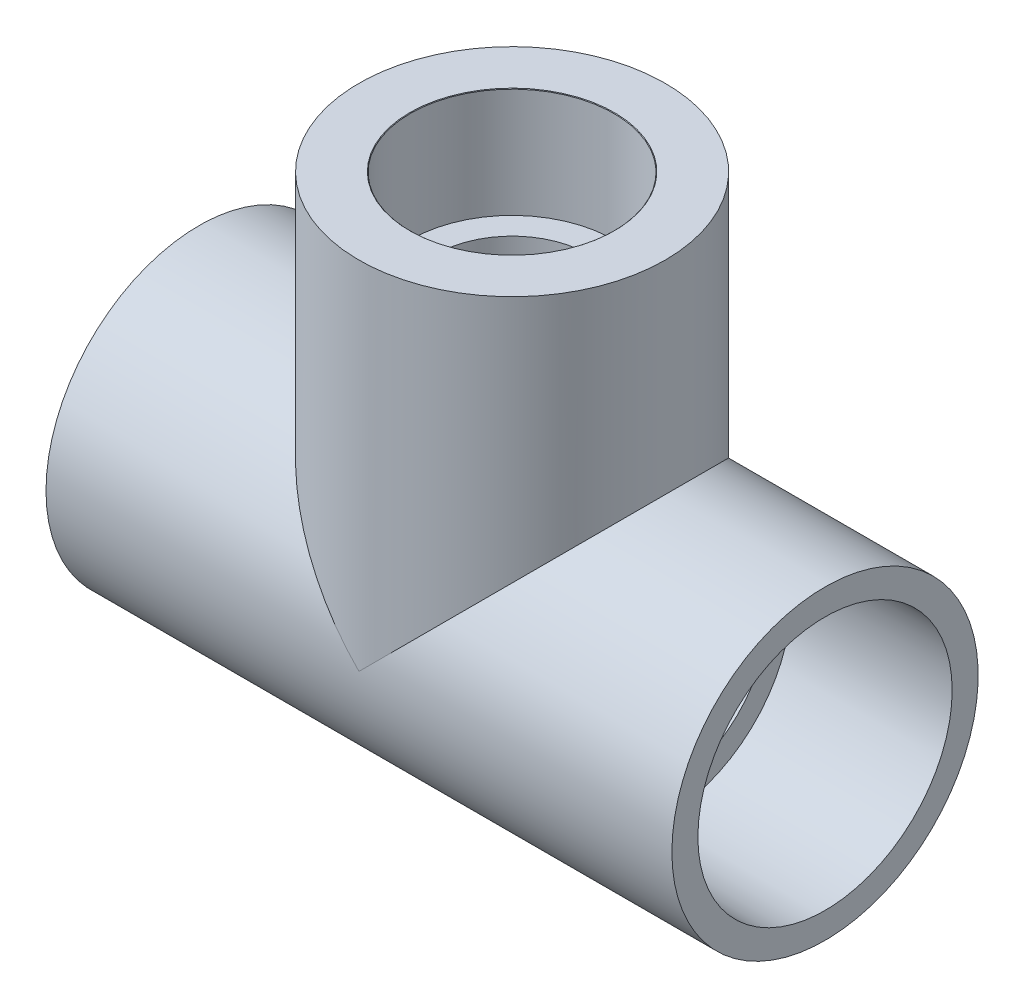
ISO-10303-21;
HEADER;
FILE_DESCRIPTION(('STEP AP214'),'2;1');
FILE_NAME('part.step','',(''),(''),'','','');
FILE_SCHEMA(('AUTOMOTIVE_DESIGN { 1 0 10303 214 1 1 1 1 }'));
ENDSEC;
DATA;
#1=APPLICATION_CONTEXT('core data for automotive mechanical design processes');
#2=APPLICATION_PROTOCOL_DEFINITION('international standard','automotive_design',2000,#1);
#3=PRODUCT_CONTEXT('',#1,'mechanical');
#4=PRODUCT('Part','Part','',(#3));
#5=PRODUCT_RELATED_PRODUCT_CATEGORY('part','',(#4));
#6=PRODUCT_DEFINITION_FORMATION('','',#4);
#7=PRODUCT_DEFINITION_CONTEXT('part definition',#1,'design');
#8=PRODUCT_DEFINITION('design','',#6,#7);
#9=PRODUCT_DEFINITION_SHAPE('','',#8);
#10=(LENGTH_UNIT() NAMED_UNIT(*) SI_UNIT(.MILLI.,.METRE.));
#11=(NAMED_UNIT(*) PLANE_ANGLE_UNIT() SI_UNIT($,.RADIAN.));
#12=(NAMED_UNIT(*) SI_UNIT($,.STERADIAN.) SOLID_ANGLE_UNIT());
#13=UNCERTAINTY_MEASURE_WITH_UNIT(LENGTH_MEASURE(1.E-05),#10,'distance_accuracy_value','');
#14=(GEOMETRIC_REPRESENTATION_CONTEXT(3) GLOBAL_UNCERTAINTY_ASSIGNED_CONTEXT((#13)) GLOBAL_UNIT_ASSIGNED_CONTEXT((#10,
#11,#12)) REPRESENTATION_CONTEXT('',''));
#15=CARTESIAN_POINT('',(0.,0.,0.));
#16=DIRECTION('',(0.,0.,1.));
#17=DIRECTION('',(1.,0.,0.));
#18=AXIS2_PLACEMENT_3D('',#15,#16,#17);
#19=CARTESIAN_POINT('',(0.,58.7375,0.));
#20=DIRECTION('',(0.,-1.,0.));
#21=DIRECTION('',(1.,0.,0.));
#22=AXIS2_PLACEMENT_3D('',#19,#20,#21);
#23=PLANE('',#22);
#24=CARTESIAN_POINT('',(0.,58.7375,0.));
#25=DIRECTION('',(0.,-1.,0.));
#26=DIRECTION('',(0.,0.,-1.));
#27=AXIS2_PLACEMENT_3D('',#24,#25,#26);
#28=CIRCLE('',#27,18.2344551523859);
#29=CARTESIAN_POINT('',(0.,58.7375,-18.2344551523859));
#30=VERTEX_POINT('',#29);
#31=EDGE_CURVE('E77',#30,#30,#28,.T.);
#32=ORIENTED_EDGE('',*,*,#31,.T.);
#33=EDGE_LOOP('',(#32));
#34=FACE_BOUND('',#33,.T.);
#35=CARTESIAN_POINT('',(0.,58.7375,0.));
#36=DIRECTION('',(0.,-1.,0.));
#37=DIRECTION('',(1.,0.,0.));
#38=AXIS2_PLACEMENT_3D('',#35,#36,#37);
#39=CIRCLE('',#38,24.28);
#40=CARTESIAN_POINT('',(24.28,58.7375,0.));
#41=VERTEX_POINT('',#40);
#42=EDGE_CURVE('E135',#41,#41,#39,.F.);
#43=ORIENTED_EDGE('',*,*,#42,.T.);
#44=EDGE_LOOP('',(#43));
#45=FACE_BOUND('',#44,.T.);
#46=ADVANCED_FACE('F39',(#34,#45),#23,.F.);
#47=CARTESIAN_POINT('',(-36.5125,0.,0.));
#48=DIRECTION('',(1.,0.,0.));
#49=DIRECTION('',(0.,0.,-1.));
#50=AXIS2_PLACEMENT_3D('',#47,#48,#49);
#51=PLANE('',#50);
#52=CARTESIAN_POINT('',(-36.5125,0.,0.));
#53=DIRECTION('',(-1.,0.,0.));
#54=DIRECTION('',(0.,0.,1.));
#55=AXIS2_PLACEMENT_3D('',#52,#53,#54);
#56=CIRCLE('',#55,30.0863);
#57=CARTESIAN_POINT('',(-36.5125,0.,30.0863));
#58=VERTEX_POINT('',#57);
#59=EDGE_CURVE('E152',#58,#58,#56,.T.);
#60=ORIENTED_EDGE('',*,*,#59,.T.);
#61=EDGE_LOOP('',(#60));
#62=FACE_BOUND('',#61,.T.);
#63=CARTESIAN_POINT('',(-36.5125,0.,0.));
#64=DIRECTION('',(1.,0.,0.));
#65=DIRECTION('',(0.,0.,-1.));
#66=AXIS2_PLACEMENT_3D('',#63,#64,#65);
#67=CIRCLE('',#66,24.6253);
#68=CARTESIAN_POINT('',(-36.5125,0.,-24.6253));
#69=VERTEX_POINT('',#68);
#70=EDGE_CURVE('E140',#69,#69,#67,.T.);
#71=ORIENTED_EDGE('',*,*,#70,.T.);
#72=EDGE_LOOP('',(#71));
#73=FACE_BOUND('',#72,.T.);
#74=ADVANCED_FACE('F98',(#62,#73),#51,.F.);
#75=CARTESIAN_POINT('',(36.5125,0.,0.));
#76=DIRECTION('',(1.,0.,0.));
#77=DIRECTION('',(0.,0.,-1.));
#78=AXIS2_PLACEMENT_3D('',#75,#76,#77);
#79=PLANE('',#78);
#80=CARTESIAN_POINT('',(36.5125,0.,0.));
#81=DIRECTION('',(1.,0.,0.));
#82=DIRECTION('',(0.,0.,-1.));
#83=AXIS2_PLACEMENT_3D('',#80,#81,#82);
#84=CIRCLE('',#83,30.0863);
#85=CARTESIAN_POINT('',(36.5125,0.,-30.0863));
#86=VERTEX_POINT('',#85);
#87=EDGE_CURVE('E63',#86,#86,#84,.F.);
#88=ORIENTED_EDGE('',*,*,#87,.F.);
#89=EDGE_LOOP('',(#88));
#90=FACE_BOUND('',#89,.T.);
#91=CARTESIAN_POINT('',(36.5125,0.,0.));
#92=DIRECTION('',(1.,0.,0.));
#93=DIRECTION('',(0.,0.,-1.));
#94=AXIS2_PLACEMENT_3D('',#91,#92,#93);
#95=CIRCLE('',#94,24.6253);
#96=CARTESIAN_POINT('',(36.5125,0.,-24.6253));
#97=VERTEX_POINT('',#96);
#98=EDGE_CURVE('E76',#97,#97,#95,.T.);
#99=ORIENTED_EDGE('',*,*,#98,.F.);
#100=EDGE_LOOP('',(#99));
#101=FACE_BOUND('',#100,.T.);
#102=ADVANCED_FACE('F105',(#90,#101),#79,.T.);
#103=CARTESIAN_POINT('',(36.5125,84.93125,0.));
#104=DIRECTION('',(0.,1.,0.));
#105=DIRECTION('',(-1.,0.,0.));
#106=AXIS2_PLACEMENT_3D('',#103,#104,#105);
#107=PLANE('',#106);
#108=CARTESIAN_POINT('',(0.,84.93125,0.));
#109=DIRECTION('',(0.,1.,0.));
#110=DIRECTION('',(-1.,0.,0.));
#111=AXIS2_PLACEMENT_3D('',#108,#109,#110);
#112=CIRCLE('',#111,24.4060869565217);
#113=CARTESIAN_POINT('',(-24.4060869565217,84.93125,0.));
#114=VERTEX_POINT('',#113);
#115=EDGE_CURVE('E129',#114,#114,#112,.T.);
#116=ORIENTED_EDGE('',*,*,#115,.F.);
#117=EDGE_LOOP('',(#116));
#118=FACE_BOUND('',#117,.T.);
#119=CARTESIAN_POINT('',(0.,84.93125,0.));
#120=DIRECTION('',(0.,-1.,0.));
#121=DIRECTION('',(1.,0.,0.));
#122=AXIS2_PLACEMENT_3D('',#119,#120,#121);
#123=CIRCLE('',#122,36.5125);
#124=CARTESIAN_POINT('',(36.5125,84.93125,0.));
#125=VERTEX_POINT('',#124);
#126=EDGE_CURVE('E12',#125,#125,#123,.T.);
#127=ORIENTED_EDGE('',*,*,#126,.F.);
#128=EDGE_LOOP('',(#127));
#129=FACE_BOUND('',#128,.T.);
#130=ADVANCED_FACE('F41',(#118,#129),#107,.T.);
#131=CARTESIAN_POINT('',(0.,0.,0.));
#132=DIRECTION('',(0.,-1.,0.));
#133=DIRECTION('',(1.,0.,0.));
#134=AXIS2_PLACEMENT_3D('',#131,#132,#133);
#135=CYLINDRICAL_SURFACE('',#134,36.5125);
#136=CARTESIAN_POINT('',(0.,0.,0.));
#137=DIRECTION('',(-0.707106781186547,-0.707106781186547,0.));
#138=DIRECTION('',(0.707106781186547,-0.707106781186547,0.));
#139=AXIS2_PLACEMENT_3D('',#136,#137,#138);
#140=ELLIPSE('',#139,51.6364726961476,36.5125);
#141=CARTESIAN_POINT('',(0.,0.,36.5125));
#142=VERTEX_POINT('',#141);
#143=CARTESIAN_POINT('',(0.,0.,-36.5125));
#144=VERTEX_POINT('',#143);
#145=EDGE_CURVE('E48',#142,#144,#140,.T.);
#146=ORIENTED_EDGE('',*,*,#145,.F.);
#147=CARTESIAN_POINT('',(0.,0.,0.));
#148=DIRECTION('',(0.707106781186547,-0.707106781186547,0.));
#149=DIRECTION('',(-0.707106781186547,-0.707106781186547,0.));
#150=AXIS2_PLACEMENT_3D('',#147,#148,#149);
#151=ELLIPSE('',#150,51.6364726961476,36.5125);
#152=EDGE_CURVE('E55',#144,#142,#151,.T.);
#153=ORIENTED_EDGE('',*,*,#152,.F.);
#154=EDGE_LOOP('',(#146,#153));
#155=FACE_BOUND('',#154,.T.);
#156=ORIENTED_EDGE('',*,*,#126,.T.);
#157=EDGE_LOOP('',(#156));
#158=FACE_BOUND('',#157,.T.);
#159=ADVANCED_FACE('F57',(#155,#158),#135,.T.);
#160=CARTESIAN_POINT('',(-74.6125,-36.5125,0.));
#161=DIRECTION('',(-1.,0.,0.));
#162=DIRECTION('',(0.,0.,1.));
#163=AXIS2_PLACEMENT_3D('',#160,#161,#162);
#164=PLANE('',#163);
#165=CARTESIAN_POINT('',(-74.6125,0.,0.));
#166=DIRECTION('',(-1.,0.,0.));
#167=DIRECTION('',(0.,0.,1.));
#168=AXIS2_PLACEMENT_3D('',#165,#166,#167);
#169=CIRCLE('',#168,36.5125);
#170=CARTESIAN_POINT('',(-74.6125,0.,36.5125));
#171=VERTEX_POINT('',#170);
#172=EDGE_CURVE('E149',#171,#171,#169,.T.);
#173=ORIENTED_EDGE('',*,*,#172,.T.);
#174=EDGE_LOOP('',(#173));
#175=FACE_BOUND('',#174,.T.);
#176=CARTESIAN_POINT('',(-74.6125,0.,0.));
#177=DIRECTION('',(-1.,0.,0.));
#178=DIRECTION('',(0.,0.,1.));
#179=AXIS2_PLACEMENT_3D('',#176,#177,#178);
#180=CIRCLE('',#179,30.3149);
#181=CARTESIAN_POINT('',(-74.6125,0.,30.3149));
#182=VERTEX_POINT('',#181);
#183=EDGE_CURVE('E66',#182,#182,#180,.T.);
#184=ORIENTED_EDGE('',*,*,#183,.F.);
#185=EDGE_LOOP('',(#184));
#186=FACE_BOUND('',#185,.T.);
#187=ADVANCED_FACE('F111',(#175,#186),#164,.T.);
#188=CARTESIAN_POINT('',(-36.5125,0.,0.));
#189=DIRECTION('',(-1.,0.,0.));
#190=DIRECTION('',(0.,0.,1.));
#191=AXIS2_PLACEMENT_3D('',#188,#189,#190);
#192=CONICAL_SURFACE('',#191,30.0863,0.00599992800155504);
#193=ORIENTED_EDGE('',*,*,#183,.T.);
#194=EDGE_LOOP('',(#193));
#195=FACE_BOUND('',#194,.T.);
#196=ORIENTED_EDGE('',*,*,#59,.F.);
#197=EDGE_LOOP('',(#196));
#198=FACE_BOUND('',#197,.T.);
#199=ADVANCED_FACE('F118',(#195,#198),#192,.F.);
#200=CARTESIAN_POINT('',(-74.6125,0.,0.));
#201=DIRECTION('',(-1.,0.,0.));
#202=DIRECTION('',(0.,0.,1.));
#203=AXIS2_PLACEMENT_3D('',#200,#201,#202);
#204=CYLINDRICAL_SURFACE('',#203,36.5125);
#205=ORIENTED_EDGE('',*,*,#152,.T.);
#206=ORIENTED_EDGE('',*,*,#145,.T.);
#207=EDGE_LOOP('',(#205,#206));
#208=FACE_BOUND('',#207,.T.);
#209=ORIENTED_EDGE('',*,*,#172,.F.);
#210=EDGE_LOOP('',(#209));
#211=FACE_BOUND('',#210,.T.);
#212=CARTESIAN_POINT('',(74.6125,0.,0.));
#213=DIRECTION('',(-1.,0.,0.));
#214=DIRECTION('',(0.,0.,1.));
#215=AXIS2_PLACEMENT_3D('',#212,#213,#214);
#216=CIRCLE('',#215,36.5125);
#217=CARTESIAN_POINT('',(74.6125,0.,36.5125));
#218=VERTEX_POINT('',#217);
#219=EDGE_CURVE('E143',#218,#218,#216,.T.);
#220=ORIENTED_EDGE('',*,*,#219,.T.);
#221=EDGE_LOOP('',(#220));
#222=FACE_BOUND('',#221,.T.);
#223=ADVANCED_FACE('F61',(#208,#211,#222),#204,.T.);
#224=CARTESIAN_POINT('',(74.6125,-36.5125,0.));
#225=DIRECTION('',(1.,0.,0.));
#226=DIRECTION('',(0.,0.,-1.));
#227=AXIS2_PLACEMENT_3D('',#224,#225,#226);
#228=PLANE('',#227);
#229=CARTESIAN_POINT('',(74.6125,0.,0.));
#230=DIRECTION('',(-1.,0.,0.));
#231=DIRECTION('',(0.,0.,1.));
#232=AXIS2_PLACEMENT_3D('',#229,#230,#231);
#233=CIRCLE('',#232,30.3149);
#234=CARTESIAN_POINT('',(74.6125,0.,30.3149));
#235=VERTEX_POINT('',#234);
#236=EDGE_CURVE('E146',#235,#235,#233,.T.);
#237=ORIENTED_EDGE('',*,*,#236,.T.);
#238=EDGE_LOOP('',(#237));
#239=FACE_BOUND('',#238,.T.);
#240=ORIENTED_EDGE('',*,*,#219,.F.);
#241=EDGE_LOOP('',(#240));
#242=FACE_BOUND('',#241,.T.);
#243=ADVANCED_FACE('F170',(#239,#242),#228,.T.);
#244=CARTESIAN_POINT('',(74.6125,0.,0.));
#245=DIRECTION('',(1.,0.,0.));
#246=DIRECTION('',(0.,0.,-1.));
#247=AXIS2_PLACEMENT_3D('',#244,#245,#246);
#248=CONICAL_SURFACE('',#247,30.3149,0.00599992800155486);
#249=ORIENTED_EDGE('',*,*,#87,.T.);
#250=EDGE_LOOP('',(#249));
#251=FACE_BOUND('',#250,.T.);
#252=ORIENTED_EDGE('',*,*,#236,.F.);
#253=EDGE_LOOP('',(#252));
#254=FACE_BOUND('',#253,.T.);
#255=ADVANCED_FACE('F165',(#251,#254),#248,.F.);
#256=CARTESIAN_POINT('',(74.6125,0.,0.));
#257=DIRECTION('',(1.,0.,0.));
#258=DIRECTION('',(0.,0.,-1.));
#259=AXIS2_PLACEMENT_3D('',#256,#257,#258);
#260=CYLINDRICAL_SURFACE('',#259,24.6253);
#261=CARTESIAN_POINT('',(0.,16.5502279556998,-18.2344551523859));
#262=CARTESIAN_POINT('',(0.427984261388474,16.550237735694,-18.2344502880527));
#263=CARTESIAN_POINT('',(0.856037152976392,16.5669219828448,-18.2193458106747));
#264=CARTESIAN_POINT('',(1.70756405799465,16.6326598306928,-18.1593480598103));
#265=CARTESIAN_POINT('',(2.13103687324421,16.6817217029236,-18.1144471741992));
#266=CARTESIAN_POINT('',(2.97021701800375,16.8095155344603,-17.995920152555));
#267=CARTESIAN_POINT('',(3.38590674145073,16.8883078232349,-17.9222355974136));
#268=CARTESIAN_POINT('',(4.20593773206111,17.071613907516,-17.7477141710312));
#269=CARTESIAN_POINT('',(4.61027157078281,17.1761441220827,-17.6468599635052));
#270=CARTESIAN_POINT('',(5.40000616474329,17.404859584572,-17.4212992265505));
#271=CARTESIAN_POINT('',(5.78559000708884,17.5287571019939,-17.2969370289475));
#272=CARTESIAN_POINT('',(6.5424860632365,17.7929308698866,-17.0250669804898));
#273=CARTESIAN_POINT('',(6.91380315015,17.9332014604801,-16.8775671218813));
#274=CARTESIAN_POINT('',(7.64176573588982,18.2262339214932,-16.5606869177692));
#275=CARTESIAN_POINT('',(7.99841304996551,18.3789942393923,-16.3913092902423));
#276=CARTESIAN_POINT('',(8.69686721322759,18.693536893704,-16.0316615137052));
#277=CARTESIAN_POINT('',(9.03867297829348,18.8553198872245,-15.8413898420326));
#278=CARTESIAN_POINT('',(9.77496890104561,19.218159227574,-15.4001614539443));
#279=CARTESIAN_POINT('',(10.1661232079162,19.4205379049874,-15.1447161055391));
#280=CARTESIAN_POINT('',(10.9264212485016,19.8291195865956,-14.6056786343255));
#281=CARTESIAN_POINT('',(11.2955632030017,20.0353228981667,-14.3220842412088));
#282=CARTESIAN_POINT('',(12.0117299479135,20.4476376589688,-13.7270067442154));
#283=CARTESIAN_POINT('',(12.3587240118362,20.6537486028786,-13.415486278005));
#284=CARTESIAN_POINT('',(13.0291137720805,21.0617459871868,-12.7654058282405));
#285=CARTESIAN_POINT('',(13.3525075707325,21.2636320869417,-12.4268436748704));
#286=CARTESIAN_POINT('',(14.0356247633383,21.6985341487295,-11.6538571239587));
#287=CARTESIAN_POINT('',(14.3899662711196,21.9298539531201,-11.2136822752733));
#288=CARTESIAN_POINT('',(15.0599339102034,22.3751886748507,-10.29642693319));
#289=CARTESIAN_POINT('',(15.3755516559948,22.5891998406511,-9.81933848260984));
#290=CARTESIAN_POINT('',(15.9637097492873,22.9935763672864,-8.83091930782539));
#291=CARTESIAN_POINT('',(16.2363288569652,23.1839848206727,-8.31965369113445));
#292=CARTESIAN_POINT('',(16.609989162818,23.4476876985242,-7.5291837210773));
#293=CARTESIAN_POINT('',(16.7286509907135,23.5319271965507,-7.26180257299516));
#294=CARTESIAN_POINT('',(16.9537509805179,23.6924773427242,-6.71951411254593));
#295=CARTESIAN_POINT('',(17.0601862064441,23.7687860860358,-6.44460501203061));
#296=CARTESIAN_POINT('',(17.3010972025054,23.9421891959232,-5.77415880879929));
#297=CARTESIAN_POINT('',(17.4292647123766,24.0350394527129,-5.37522293264748));
#298=CARTESIAN_POINT('',(17.6585634755247,24.2018330463044,-4.56589027877172));
#299=CARTESIAN_POINT('',(17.7597010351359,24.2757807930588,-4.15549619907305));
#300=CARTESIAN_POINT('',(17.9335819741709,24.4032766503275,-3.32587847282086));
#301=CARTESIAN_POINT('',(18.0063440927341,24.4568382233063,-2.90666084682093));
#302=CARTESIAN_POINT('',(18.1225095720258,24.5424908401833,-2.06197595693009));
#303=CARTESIAN_POINT('',(18.165911890767,24.5745811220592,-1.63650847177745));
#304=CARTESIAN_POINT('',(18.2227550396866,24.6166301102938,-0.781411899605129));
#305=CARTESIAN_POINT('',(18.236121095942,24.6265335834037,-0.351775094862984));
#306=CARTESIAN_POINT('',(18.2324576029764,24.6238208707696,0.507295184505696));
#307=CARTESIAN_POINT('',(18.2154281724509,24.6112047729653,0.936728659919689));
#308=CARTESIAN_POINT('',(18.1512391860819,24.5637347423635,1.79217663229047));
#309=CARTESIAN_POINT('',(18.104073420494,24.5288762264052,2.21819040627718));
#310=CARTESIAN_POINT('',(17.980332695307,24.437689369649,3.06357578388356));
#311=CARTESIAN_POINT('',(17.9037578859065,24.3813611385017,3.48294742141469));
#312=CARTESIAN_POINT('',(17.7252291134625,24.2505717010929,4.29888321548475));
#313=CARTESIAN_POINT('',(17.6241697152199,24.1767513156097,4.69574723241674));
#314=CARTESIAN_POINT('',(17.3968025019541,24.0115115351982,5.4783828916275));
#315=CARTESIAN_POINT('',(17.2704954072523,23.9200926423612,5.86415485000565));
#316=CARTESIAN_POINT('',(16.9940263368011,23.7212510821639,6.62279707939715));
#317=CARTESIAN_POINT('',(16.8438632944976,23.6138276992866,6.99566677266659));
#318=CARTESIAN_POINT('',(16.5211262384744,23.3847117256672,7.72706708666617));
#319=CARTESIAN_POINT('',(16.3485491786858,23.2630171956924,8.08559574976992));
#320=CARTESIAN_POINT('',(15.9624194226745,22.9932112042617,8.82548330536553));
#321=CARTESIAN_POINT('',(15.7464499906076,22.8436661831842,9.20505797645315));
#322=CARTESIAN_POINT('',(15.2905404858767,22.5318223472903,9.94400573396878));
#323=CARTESIAN_POINT('',(15.0505989357638,22.3695227465158,10.3033775731208));
#324=CARTESIAN_POINT('',(14.5481980527643,22.0346320667377,11.0013786039111));
#325=CARTESIAN_POINT('',(14.285722671534,21.8620336801846,11.3399927129686));
#326=CARTESIAN_POINT('',(13.7397747403777,21.5092550570343,11.9956648444938));
#327=CARTESIAN_POINT('',(13.45630013308,21.3290740782916,12.3127207489728));
#328=CARTESIAN_POINT('',(12.812592324812,20.9283853958321,12.9841855891699));
#329=CARTESIAN_POINT('',(12.4481301033881,20.7068296277787,13.3339255954799));
#330=CARTESIAN_POINT('',(11.6922430269415,20.261423891352,14.0014691148936));
#331=CARTESIAN_POINT('',(11.3008128967867,20.0375734814598,14.319266349679));
#332=CARTESIAN_POINT('',(10.4917644668354,19.592675188432,14.9222279816174));
#333=CARTESIAN_POINT('',(10.0741354623464,19.3716284958112,15.2073789034847));
#334=CARTESIAN_POINT('',(9.21339115438799,18.9382770715412,15.7437557422529));
#335=CARTESIAN_POINT('',(8.77028200099252,18.7259702514249,15.9949897969721));
#336=CARTESIAN_POINT('',(7.95302585985206,18.3590952411216,16.413706406983));
#337=CARTESIAN_POINT('',(7.58353219734718,18.2016569600841,16.5877706648339));
#338=CARTESIAN_POINT('',(6.82892313435334,17.9004073886766,16.9124166500514));
#339=CARTESIAN_POINT('',(6.44380815105654,17.7565957347277,17.06299900402));
#340=CARTESIAN_POINT('',(5.65929429338851,17.4872018713286,17.3389824896433));
#341=CARTESIAN_POINT('',(5.25992347820311,17.361586073911,17.4644301861189));
#342=CARTESIAN_POINT('',(4.44745875362609,17.1329562662493,17.6887794694189));
#343=CARTESIAN_POINT('',(4.0343681085596,17.0299369234193,17.7876873206717));
#344=CARTESIAN_POINT('',(3.27335301478156,16.8675167532936,17.9416387782887));
#345=CARTESIAN_POINT('',(2.92734834870125,16.8035829844835,18.0013982122986));
#346=CARTESIAN_POINT('',(2.22934917958457,16.6961440433012,18.1010932451351));
#347=CARTESIAN_POINT('',(1.87735542318093,16.6526363435614,18.141031296545));
#348=CARTESIAN_POINT('',(1.16991700028077,16.5877916110008,18.2003438800269));
#349=CARTESIAN_POINT('',(0.814475818404669,16.566434154108,18.2197373559879));
#350=CARTESIAN_POINT('',(0.102415071176535,16.5467183769754,18.2376450228102));
#351=CARTESIAN_POINT('',(-0.254204512733124,16.548360420677,18.2361588832748));
#352=CARTESIAN_POINT('',(-0.965741339140704,16.5745689397839,18.2123410988912));
#353=CARTESIAN_POINT('',(-1.3206592230711,16.5991259602474,18.1900180515522));
#354=CARTESIAN_POINT('',(-2.02637977396267,16.6701218768843,18.12497539152));
#355=CARTESIAN_POINT('',(-2.37718244052072,16.7165607752013,18.0822557768288));
#356=CARTESIAN_POINT('',(-3.07297529503388,16.8295925148788,17.9771008416196));
#357=CARTESIAN_POINT('',(-3.41795721407392,16.8962118345429,17.9146396138499));
#358=CARTESIAN_POINT('',(-4.10004758270949,17.0472791123109,17.7709460298166));
#359=CARTESIAN_POINT('',(-4.43715387409534,17.1317318952371,17.6897085931086));
#360=CARTESIAN_POINT('',(-5.23147187063052,17.3517005713737,17.474434706951));
#361=CARTESIAN_POINT('',(-5.6844971435201,17.4943112008459,17.3321448040709));
#362=CARTESIAN_POINT('',(-6.57131947314643,17.80222152238,17.0157281728821));
#363=CARTESIAN_POINT('',(-7.0051085957408,17.9675304635244,16.8415884567937));
#364=CARTESIAN_POINT('',(-7.85325688352567,18.3148510166442,16.4632219258652));
#365=CARTESIAN_POINT('',(-8.26758404011188,18.4968887821822,16.2589476867956));
#366=CARTESIAN_POINT('',(-9.07569113098057,18.8719401430347,15.8220782500593));
#367=CARTESIAN_POINT('',(-9.46947312632763,19.0649526333033,15.5894859010635));
#368=CARTESIAN_POINT('',(-10.24913225427,19.4637828610399,15.0888167340762));
#369=CARTESIAN_POINT('',(-10.6343050841222,19.6698129740354,14.8198136269868));
#370=CARTESIAN_POINT('',(-11.3820955891667,20.0839551512414,14.2535336211767));
#371=CARTESIAN_POINT('',(-11.7447123575006,20.2920672987694,13.9562555868866));
#372=CARTESIAN_POINT('',(-12.4464479796054,20.7061329049237,13.3342039264248));
#373=CARTESIAN_POINT('',(-12.7855796989924,20.9120874921728,13.0094455747356));
#374=CARTESIAN_POINT('',(-13.4394374767183,21.318135185549,12.3328095134206));
#375=CARTESIAN_POINT('',(-13.7541642211489,21.5182284563554,11.9809325667287));
#376=CARTESIAN_POINT('',(-14.3572028268449,21.9085966480099,11.2512102998687));
#377=CARTESIAN_POINT('',(-14.6455567671671,22.0988869902313,10.8734080924778));
#378=CARTESIAN_POINT('',(-15.1945086827459,22.4664547856313,10.0920852897488));
#379=CARTESIAN_POINT('',(-15.455105673189,22.6437317770283,9.68856378270408));
#380=CARTESIAN_POINT('',(-15.9460777843231,22.9816394985678,8.85724697085343));
#381=CARTESIAN_POINT('',(-16.1764724648067,23.1422809879872,8.42946763581438));
#382=CARTESIAN_POINT('',(-16.6046441048767,23.4435729281821,7.55113984021003));
#383=CARTESIAN_POINT('',(-16.8024267260389,23.5842268482876,7.10059534954131));
#384=CARTESIAN_POINT('',(-17.1353223873068,23.8226357677689,6.24916999196174));
#385=CARTESIAN_POINT('',(-17.2753912919495,23.9236617137799,5.85113802095053));
#386=CARTESIAN_POINT('',(-17.5285248582609,24.1070863642481,5.04238479940736));
#387=CARTESIAN_POINT('',(-17.641592078584,24.1894868335985,4.63166475535414));
#388=CARTESIAN_POINT('',(-17.8391985751855,24.3339784898522,3.80011521779243));
#389=CARTESIAN_POINT('',(-17.9237522476912,24.3960799250628,3.379290941134));
#390=CARTESIAN_POINT('',(-18.0631918540229,24.4987084201431,2.53013145343135));
#391=CARTESIAN_POINT('',(-18.1180774540564,24.5392352372789,2.10179615793737));
#392=CARTESIAN_POINT('',(-18.1974481415604,24.5978951307685,1.23946426025296));
#393=CARTESIAN_POINT('',(-18.2218404966955,24.6159598973874,0.805454425353338));
#394=CARTESIAN_POINT('',(-18.2395225628098,24.629051806333,-0.0635496737661525));
#395=CARTESIAN_POINT('',(-18.2328122114191,24.6240789024627,-0.498543939958339));
#396=CARTESIAN_POINT('',(-18.1883969657653,24.5912099769739,-1.36611176790432));
#397=CARTESIAN_POINT('',(-18.1506888900429,24.563311602394,-1.7986850765941));
#398=CARTESIAN_POINT('',(-18.044877256426,24.4852275216818,-2.65804131776044));
#399=CARTESIAN_POINT('',(-17.9767742030799,24.4350421855069,-3.08482434623291));
#400=CARTESIAN_POINT('',(-17.8150007098724,24.3162790829614,-3.91022041396656));
#401=CARTESIAN_POINT('',(-17.7226423086155,24.2486476571605,-4.30922901964041));
#402=CARTESIAN_POINT('',(-17.5123753255501,24.0953969525165,-5.09688341522059));
#403=CARTESIAN_POINT('',(-17.3944677228142,24.0097783629645,-5.48552960158511));
#404=CARTESIAN_POINT('',(-17.1344474465739,23.82207466725,-6.25054453177472));
#405=CARTESIAN_POINT('',(-16.992333507638,23.7199887002393,-6.62691263251367));
#406=CARTESIAN_POINT('',(-16.6853262935088,23.5010336438982,-7.36582295228225));
#407=CARTESIAN_POINT('',(-16.5204299762007,23.3841625805003,-7.72836331664052));
#408=CARTESIAN_POINT('',(-16.1520386743188,23.1253013614233,-8.47326396093621));
#409=CARTESIAN_POINT('',(-15.9463428533371,22.9819713242414,-8.85406966398284));
#410=CARTESIAN_POINT('',(-15.5110282345794,22.6820886935114,-9.59627513115392));
#411=CARTESIAN_POINT('',(-15.2814081313849,22.525535378529,-9.95767383471155));
#412=CARTESIAN_POINT('',(-14.7997428066873,22.201590879575,-10.6604196061155));
#413=CARTESIAN_POINT('',(-14.5476843629952,22.0341933214718,-11.0017546517822));
#414=CARTESIAN_POINT('',(-14.0226613126262,21.6911406803011,-11.663566144535));
#415=CARTESIAN_POINT('',(-13.7496945928246,21.5154847632855,-11.9840404772327));
#416=CARTESIAN_POINT('',(-13.1299413886949,21.1243232432517,-12.662927445877));
#417=CARTESIAN_POINT('',(-12.7790181803992,20.9076187044411,-13.0168819009975));
#418=CARTESIAN_POINT('',(-12.050637376264,20.4705395024961,-13.693970271444));
#419=CARTESIAN_POINT('',(-11.673175052232,20.250164190743,-14.0170986705276));
#420=CARTESIAN_POINT('',(-10.8924985584749,19.8104125269173,-14.6320163845797));
#421=CARTESIAN_POINT('',(-10.4892676235827,19.5910369267522,-14.9237849588021));
#422=CARTESIAN_POINT('',(-9.65790887674317,19.1587876214399,-15.4747791174681));
#423=CARTESIAN_POINT('',(-9.22978578434252,18.9459126953649,-15.7340108416394));
#424=CARTESIAN_POINT('',(-8.42200186433674,18.5670397043643,-16.1784125652945));
#425=CARTESIAN_POINT('',(-8.04607363979979,18.3991209804931,-16.368735977756));
#426=CARTESIAN_POINT('',(-7.2772859468963,18.0761518846309,-16.7247085361659));
#427=CARTESIAN_POINT('',(-6.88442620915225,17.9211017174914,-16.8903572893578));
#428=CARTESIAN_POINT('',(-6.08307112371885,17.6288092245025,-17.1952031792367));
#429=CARTESIAN_POINT('',(-5.67460781860514,17.4915327035382,-17.3344513558045));
#430=CARTESIAN_POINT('',(-4.84243842623296,17.2395548567624,-17.5850726559396));
#431=CARTESIAN_POINT('',(-4.41873727930265,17.1248462907623,-17.6964547225603));
#432=CARTESIAN_POINT('',(-3.66664687192334,16.9486408506622,-17.8650457192332));
#433=CARTESIAN_POINT('',(-3.34115630110839,16.8810194950258,-17.9288328966233));
#434=CARTESIAN_POINT('',(-2.68409726591117,16.7633539138923,-18.0388990069546));
#435=CARTESIAN_POINT('',(-2.35252981341481,16.7133067895216,-18.0851808275058));
#436=CARTESIAN_POINT('',(-1.68528392096008,16.6325193530189,-18.1595081515657));
#437=CARTESIAN_POINT('',(-1.34960919159375,16.6017627621178,-18.1875690319499));
#438=CARTESIAN_POINT('',(-0.675970631516913,16.5606128358747,-18.2250447880019));
#439=CARTESIAN_POINT('',(-0.338006719038551,16.5502202318088,-18.2344589940629));
#440=CARTESIAN_POINT('',(0.,16.5502279556998,-18.2344551523859));
#441=B_SPLINE_CURVE_WITH_KNOTS('',3,(#261,#262,#263,#264,#265,#266,#267,#268,#269,#270,#271,
#272,#273,#274,#275,#276,#277,#278,#279,#280,#281,#282,#283,#284,#285,#286,#287,#288,#289,#290,
#291,#292,#293,#294,#295,#296,#297,#298,#299,#300,#301,#302,#303,#304,#305,#306,#307,#308,#309,
#310,#311,#312,#313,#314,#315,#316,#317,#318,#319,#320,#321,#322,#323,#324,#325,#326,#327,#328,
#329,#330,#331,#332,#333,#334,#335,#336,#337,#338,#339,#340,#341,#342,#343,#344,#345,#346,#347,
#348,#349,#350,#351,#352,#353,#354,#355,#356,#357,#358,#359,#360,#361,#362,#363,#364,#365,#366,
#367,#368,#369,#370,#371,#372,#373,#374,#375,#376,#377,#378,#379,#380,#381,#382,#383,#384,#385,
#386,#387,#388,#389,#390,#391,#392,#393,#394,#395,#396,#397,#398,#399,#400,#401,#402,#403,#404,
#405,#406,#407,#408,#409,#410,#411,#412,#413,#414,#415,#416,#417,#418,#419,#420,#421,#422,#423,
#424,#425,#426,#427,#428,#429,#430,#431,#432,#433,#434,#435,#436,#437,#438,#439,#440),
.UNSPECIFIED.,.T.,.F.,(4,2,2,2,2,2,2,2,2,2,2,2,2,2,2,2,2,2,2,2,2,2,2,2,2,2,2,2,2,2,2,2,2,2,2,2,
2,2,2,2,2,2,2,2,2,2,2,2,2,2,2,2,2,2,2,2,2,2,2,2,2,2,2,2,2,2,2,2,2,2,2,2,2,2,2,2,2,2,2,2,2,2,2,2,
2,2,2,2,2,4),(0.,1.28349671319318,2.56732144915233,3.85376547800634,5.14103230729118,
6.41073006241596,7.67999019847188,8.9490927998545,10.2182879490892,11.7443213634932,
13.2704779574198,14.7987077731681,16.3270603369947,18.156300718581,19.9859365199983,
21.8121810691111,22.7250585601477,23.6381548049058,24.92427778337,26.2101004351268,
27.4950724858464,28.7800901381806,30.0683032568273,31.3565113449637,32.6449849605415,
33.9334519956872,35.1805171153708,36.4275466611342,37.6746319749218,38.9218869455032,
40.3053861553441,41.6889706856249,43.0735488961184,44.4582629387234,46.1113316763404,
47.7647246901429,49.4187977263193,51.0724731856734,52.3846814673391,53.6968547274433,
55.0065740899544,56.3159840356332,57.3856015293395,58.4550866417416,59.5235847349965,
60.5920997360647,61.6601740523235,62.7282484732066,63.7977304069958,64.867502059419,
66.352632264756,67.8383694351589,69.3264702349066,70.8144214620859,72.352113431607,
73.8898671835682,75.426771745387,76.9636330848747,78.4979978752507,80.0324170866083,
81.565837606895,83.0989916387087,84.3993103433527,85.6995057820719,86.9990437778026,
88.2985963942016,89.6020915128403,90.9055892453597,92.209220779407,93.5128306743322,
94.756809160044,96.0007399836046,97.2447358559452,98.4888979990049,99.8553537105879,
101.221884021329,102.589224983076,103.956704319888,105.585585302144,107.214757223794,
108.845000100709,110.474934885598,111.834649200277,113.194385155772,114.551464930817,
115.908108618796,116.922756883038,117.937237702102,118.9508612718,119.964521240313),.UNSPECIFIED.);
#442=CARTESIAN_POINT('',(0.,16.5502279556998,-18.2344551523859));
#443=VERTEX_POINT('',#442);
#444=EDGE_CURVE('E69',#443,#443,#441,.T.);
#445=ORIENTED_EDGE('',*,*,#444,.F.);
#446=EDGE_LOOP('',(#445));
#447=FACE_BOUND('',#446,.T.);
#448=ORIENTED_EDGE('',*,*,#98,.T.);
#449=EDGE_LOOP('',(#448));
#450=FACE_BOUND('',#449,.T.);
#451=ORIENTED_EDGE('',*,*,#70,.F.);
#452=EDGE_LOOP('',(#451));
#453=FACE_BOUND('',#452,.T.);
#454=ADVANCED_FACE('F78',(#447,#450,#453),#260,.F.);
#455=CARTESIAN_POINT('',(0.,0.,0.));
#456=DIRECTION('',(0.,-1.,0.));
#457=DIRECTION('',(0.,0.,-1.));
#458=AXIS2_PLACEMENT_3D('',#455,#456,#457);
#459=CYLINDRICAL_SURFACE('',#458,18.2344551523859);
#460=ORIENTED_EDGE('',*,*,#444,.T.);
#461=EDGE_LOOP('',(#460));
#462=FACE_BOUND('',#461,.T.);
#463=ORIENTED_EDGE('',*,*,#31,.F.);
#464=EDGE_LOOP('',(#463));
#465=FACE_BOUND('',#464,.T.);
#466=ADVANCED_FACE('F81',(#462,#465),#459,.F.);
#467=CARTESIAN_POINT('',(0.,84.93125,0.));
#468=DIRECTION('',(0.,1.,0.));
#469=DIRECTION('',(-1.,0.,0.));
#470=AXIS2_PLACEMENT_3D('',#467,#468,#469);
#471=CONICAL_SURFACE('',#470,24.4060869565217,0.78539816339745);
#472=CARTESIAN_POINT('',(0.,84.8051630434783,0.));
#473=DIRECTION('',(0.,1.,0.));
#474=DIRECTION('',(-1.,0.,0.));
#475=AXIS2_PLACEMENT_3D('',#472,#473,#474);
#476=CIRCLE('',#475,24.28);
#477=CARTESIAN_POINT('',(-24.28,84.8051630434783,0.));
#478=VERTEX_POINT('',#477);
#479=EDGE_CURVE('E43',#478,#478,#476,.F.);
#480=ORIENTED_EDGE('',*,*,#479,.T.);
#481=EDGE_LOOP('',(#480));
#482=FACE_BOUND('',#481,.T.);
#483=ORIENTED_EDGE('',*,*,#115,.T.);
#484=EDGE_LOOP('',(#483));
#485=FACE_BOUND('',#484,.T.);
#486=ADVANCED_FACE('F85',(#482,#485),#471,.F.);
#487=CARTESIAN_POINT('',(0.,-9.93671058883752,0.));
#488=DIRECTION('',(0.,1.,0.));
#489=DIRECTION('',(-1.,0.,0.));
#490=AXIS2_PLACEMENT_3D('',#487,#488,#489);
#491=CYLINDRICAL_SURFACE('',#490,24.28);
#492=ORIENTED_EDGE('',*,*,#42,.F.);
#493=EDGE_LOOP('',(#492));
#494=FACE_BOUND('',#493,.T.);
#495=ORIENTED_EDGE('',*,*,#479,.F.);
#496=EDGE_LOOP('',(#495));
#497=FACE_BOUND('',#496,.T.);
#498=ADVANCED_FACE('F89',(#494,#497),#491,.F.);
#499=CLOSED_SHELL('',(#46,#74,#102,#130,#159,#187,#199,#223,#243,#255,#454,#466,#486,#498));
#500=MANIFOLD_SOLID_BREP('B2',#499);
#501=ADVANCED_BREP_SHAPE_REPRESENTATION('',(#18,#500),#14);
#502=SHAPE_DEFINITION_REPRESENTATION(#9,#501);
ENDSEC;
END-ISO-10303-21;
